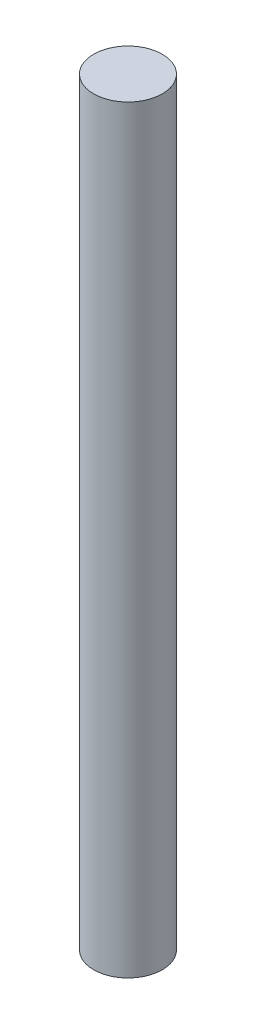
ISO-10303-21;
HEADER;
FILE_DESCRIPTION(('STEP AP214'),'2;1');
FILE_NAME('part.step','',(''),(''),'','','');
FILE_SCHEMA(('AUTOMOTIVE_DESIGN { 1 0 10303 214 1 1 1 1 }'));
ENDSEC;
DATA;
#1=APPLICATION_CONTEXT('core data for automotive mechanical design processes');
#2=APPLICATION_PROTOCOL_DEFINITION('international standard','automotive_design',2000,#1);
#3=PRODUCT_CONTEXT('',#1,'mechanical');
#4=PRODUCT('Part','Part','',(#3));
#5=PRODUCT_RELATED_PRODUCT_CATEGORY('part','',(#4));
#6=PRODUCT_DEFINITION_FORMATION('','',#4);
#7=PRODUCT_DEFINITION_CONTEXT('part definition',#1,'design');
#8=PRODUCT_DEFINITION('design','',#6,#7);
#9=PRODUCT_DEFINITION_SHAPE('','',#8);
#10=(LENGTH_UNIT() NAMED_UNIT(*) SI_UNIT(.MILLI.,.METRE.));
#11=(NAMED_UNIT(*) PLANE_ANGLE_UNIT() SI_UNIT($,.RADIAN.));
#12=(NAMED_UNIT(*) SI_UNIT($,.STERADIAN.) SOLID_ANGLE_UNIT());
#13=UNCERTAINTY_MEASURE_WITH_UNIT(LENGTH_MEASURE(1.E-05),#10,'distance_accuracy_value','');
#14=(GEOMETRIC_REPRESENTATION_CONTEXT(3) GLOBAL_UNCERTAINTY_ASSIGNED_CONTEXT((#13)) GLOBAL_UNIT_ASSIGNED_CONTEXT((#10,
#11,#12)) REPRESENTATION_CONTEXT('',''));
#15=CARTESIAN_POINT('',(0.,0.,0.));
#16=DIRECTION('',(0.,0.,1.));
#17=DIRECTION('',(1.,0.,0.));
#18=AXIS2_PLACEMENT_3D('',#15,#16,#17);
#19=CARTESIAN_POINT('',(0.,21.,0.));
#20=DIRECTION('',(0.,-1.,0.));
#21=DIRECTION('',(0.,0.,-1.));
#22=AXIS2_PLACEMENT_3D('',#19,#20,#21);
#23=CYLINDRICAL_SURFACE('',#22,0.95);
#24=CARTESIAN_POINT('',(0.,21.,0.));
#25=DIRECTION('',(0.,1.,0.));
#26=DIRECTION('',(0.,0.,1.));
#27=AXIS2_PLACEMENT_3D('',#24,#25,#26);
#28=CIRCLE('',#27,0.95);
#29=CARTESIAN_POINT('',(0.,21.,0.95));
#30=VERTEX_POINT('',#29);
#31=EDGE_CURVE('E10',#30,#30,#28,.T.);
#32=ORIENTED_EDGE('',*,*,#31,.F.);
#33=EDGE_LOOP('',(#32));
#34=FACE_BOUND('',#33,.T.);
#35=CARTESIAN_POINT('',(0.,0.,0.));
#36=DIRECTION('',(0.,1.,0.));
#37=DIRECTION('',(0.,0.,1.));
#38=AXIS2_PLACEMENT_3D('',#35,#36,#37);
#39=CIRCLE('',#38,0.95);
#40=CARTESIAN_POINT('',(0.,0.,0.95));
#41=VERTEX_POINT('',#40);
#42=EDGE_CURVE('E44',#41,#41,#39,.T.);
#43=ORIENTED_EDGE('',*,*,#42,.T.);
#44=EDGE_LOOP('',(#43));
#45=FACE_BOUND('',#44,.T.);
#46=ADVANCED_FACE('F41',(#34,#45),#23,.T.);
#47=CARTESIAN_POINT('',(0.,21.,0.));
#48=DIRECTION('',(0.,1.,0.));
#49=DIRECTION('',(0.,0.,1.));
#50=AXIS2_PLACEMENT_3D('',#47,#48,#49);
#51=PLANE('',#50);
#52=ORIENTED_EDGE('',*,*,#31,.T.);
#53=EDGE_LOOP('',(#52));
#54=FACE_BOUND('',#53,.T.);
#55=ADVANCED_FACE('F58',(#54),#51,.T.);
#56=CARTESIAN_POINT('',(0.,0.,0.));
#57=DIRECTION('',(0.,1.,0.));
#58=DIRECTION('',(0.,0.,1.));
#59=AXIS2_PLACEMENT_3D('',#56,#57,#58);
#60=PLANE('',#59);
#61=ORIENTED_EDGE('',*,*,#42,.F.);
#62=EDGE_LOOP('',(#61));
#63=FACE_BOUND('',#62,.T.);
#64=ADVANCED_FACE('F56',(#63),#60,.F.);
#65=CLOSED_SHELL('',(#46,#55,#64));
#66=MANIFOLD_SOLID_BREP('B2',#65);
#67=ADVANCED_BREP_SHAPE_REPRESENTATION('',(#18,#66),#14);
#68=SHAPE_DEFINITION_REPRESENTATION(#9,#67);
ENDSEC;
END-ISO-10303-21;
